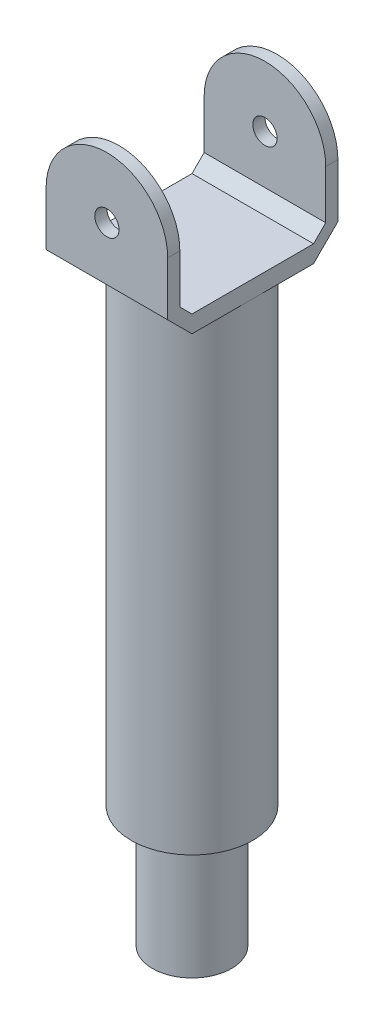
ISO-10303-21;
HEADER;
FILE_DESCRIPTION(('STEP AP214'),'2;1');
FILE_NAME('part.step','',(''),(''),'','','');
FILE_SCHEMA(('AUTOMOTIVE_DESIGN { 1 0 10303 214 1 1 1 1 }'));
ENDSEC;
DATA;
#1=APPLICATION_CONTEXT('core data for automotive mechanical design processes');
#2=APPLICATION_PROTOCOL_DEFINITION('international standard','automotive_design',2000,#1);
#3=PRODUCT_CONTEXT('',#1,'mechanical');
#4=PRODUCT('Part','Part','',(#3));
#5=PRODUCT_RELATED_PRODUCT_CATEGORY('part','',(#4));
#6=PRODUCT_DEFINITION_FORMATION('','',#4);
#7=PRODUCT_DEFINITION_CONTEXT('part definition',#1,'design');
#8=PRODUCT_DEFINITION('design','',#6,#7);
#9=PRODUCT_DEFINITION_SHAPE('','',#8);
#10=(LENGTH_UNIT() NAMED_UNIT(*) SI_UNIT(.MILLI.,.METRE.));
#11=(NAMED_UNIT(*) PLANE_ANGLE_UNIT() SI_UNIT($,.RADIAN.));
#12=(NAMED_UNIT(*) SI_UNIT($,.STERADIAN.) SOLID_ANGLE_UNIT());
#13=UNCERTAINTY_MEASURE_WITH_UNIT(LENGTH_MEASURE(1.E-05),#10,'distance_accuracy_value','');
#14=(GEOMETRIC_REPRESENTATION_CONTEXT(3) GLOBAL_UNCERTAINTY_ASSIGNED_CONTEXT((#13)) GLOBAL_UNIT_ASSIGNED_CONTEXT((#10,
#11,#12)) REPRESENTATION_CONTEXT('',''));
#15=CARTESIAN_POINT('',(0.,0.,0.));
#16=DIRECTION('',(0.,0.,1.));
#17=DIRECTION('',(1.,0.,0.));
#18=AXIS2_PLACEMENT_3D('',#15,#16,#17);
#19=CARTESIAN_POINT('',(50.,0.,0.));
#20=DIRECTION('',(-1.,0.,0.));
#21=DIRECTION('',(0.,0.,1.));
#22=AXIS2_PLACEMENT_3D('',#19,#20,#21);
#23=PLANE('',#22);
#24=DIRECTION('',(0.,0.,1.));
#25=VECTOR('',#24,1.);
#26=CARTESIAN_POINT('',(50.,550.,-70.));
#27=LINE('',#26,#25);
#28=CARTESIAN_POINT('',(50.,550.,60.));
#29=VERTEX_POINT('',#28);
#30=CARTESIAN_POINT('',(50.,550.,69.9999999999999));
#31=VERTEX_POINT('',#30);
#32=EDGE_CURVE('E243',#29,#31,#27,.T.);
#33=ORIENTED_EDGE('',*,*,#32,.T.);
#34=DIRECTION('',(0.,-1.,0.));
#35=VECTOR('',#34,1.);
#36=CARTESIAN_POINT('',(50.,600.,70.));
#37=LINE('',#36,#35);
#38=CARTESIAN_POINT('',(50.,505.857864376269,70.));
#39=VERTEX_POINT('',#38);
#40=EDGE_CURVE('E41',#31,#39,#37,.T.);
#41=ORIENTED_EDGE('',*,*,#40,.T.);
#42=DIRECTION('',(0.,-0.707106781186546,-0.707106781186549));
#43=VECTOR('',#42,1.);
#44=CARTESIAN_POINT('',(50.,505.857864376269,70.));
#45=LINE('',#44,#43);
#46=CARTESIAN_POINT('',(50.,485.857864376269,50.));
#47=VERTEX_POINT('',#46);
#48=EDGE_CURVE('E286',#39,#47,#45,.T.);
#49=ORIENTED_EDGE('',*,*,#48,.T.);
#50=DIRECTION('',(0.,0.,-1.));
#51=VECTOR('',#50,1.);
#52=CARTESIAN_POINT('',(50.,485.857864376269,50.));
#53=LINE('',#52,#51);
#54=CARTESIAN_POINT('',(50.,485.857864376269,0.));
#55=VERTEX_POINT('',#54);
#56=EDGE_CURVE('E293',#47,#55,#53,.T.);
#57=ORIENTED_EDGE('',*,*,#56,.T.);
#58=CARTESIAN_POINT('',(50.,485.857864376269,-50.));
#59=VERTEX_POINT('',#58);
#60=EDGE_CURVE('E292',#55,#59,#53,.T.);
#61=ORIENTED_EDGE('',*,*,#60,.T.);
#62=DIRECTION('',(0.,0.707106781186548,-0.707106781186546));
#63=VECTOR('',#62,1.);
#64=CARTESIAN_POINT('',(50.,485.857864376269,-50.));
#65=LINE('',#64,#63);
#66=CARTESIAN_POINT('',(50.,505.857864376269,-70.));
#67=VERTEX_POINT('',#66);
#68=EDGE_CURVE('E266',#59,#67,#65,.T.);
#69=ORIENTED_EDGE('',*,*,#68,.T.);
#70=DIRECTION('',(0.,1.,0.));
#71=VECTOR('',#70,1.);
#72=CARTESIAN_POINT('',(50.,505.857864376269,-70.));
#73=LINE('',#72,#71);
#74=CARTESIAN_POINT('',(50.,550.,-70.));
#75=VERTEX_POINT('',#74);
#76=EDGE_CURVE('E258',#67,#75,#73,.T.);
#77=ORIENTED_EDGE('',*,*,#76,.T.);
#78=CARTESIAN_POINT('',(50.,550.,-60.));
#79=VERTEX_POINT('',#78);
#80=EDGE_CURVE('E148',#75,#79,#27,.T.);
#81=ORIENTED_EDGE('',*,*,#80,.T.);
#82=DIRECTION('',(0.,-1.,0.));
#83=VECTOR('',#82,1.);
#84=CARTESIAN_POINT('',(50.,600.,-60.));
#85=LINE('',#84,#83);
#86=CARTESIAN_POINT('',(50.,510.,-60.));
#87=VERTEX_POINT('',#86);
#88=EDGE_CURVE('E255',#79,#87,#85,.T.);
#89=ORIENTED_EDGE('',*,*,#88,.T.);
#90=DIRECTION('',(0.,-0.707106781186549,0.707106781186546));
#91=VECTOR('',#90,1.);
#92=CARTESIAN_POINT('',(50.,510.,-60.));
#93=LINE('',#92,#91);
#94=CARTESIAN_POINT('',(50.,500.,-50.));
#95=VERTEX_POINT('',#94);
#96=EDGE_CURVE('E190',#87,#95,#93,.T.);
#97=ORIENTED_EDGE('',*,*,#96,.T.);
#98=DIRECTION('',(0.,0.,1.));
#99=VECTOR('',#98,1.);
#100=CARTESIAN_POINT('',(50.,500.,-50.));
#101=LINE('',#100,#99);
#102=CARTESIAN_POINT('',(50.,500.,50.));
#103=VERTEX_POINT('',#102);
#104=EDGE_CURVE('E186',#95,#103,#101,.T.);
#105=ORIENTED_EDGE('',*,*,#104,.T.);
#106=DIRECTION('',(0.,0.707106781186548,0.707106781186547));
#107=VECTOR('',#106,1.);
#108=CARTESIAN_POINT('',(50.,500.,50.));
#109=LINE('',#108,#107);
#110=CARTESIAN_POINT('',(50.,510.,60.));
#111=VERTEX_POINT('',#110);
#112=EDGE_CURVE('E284',#103,#111,#109,.T.);
#113=ORIENTED_EDGE('',*,*,#112,.T.);
#114=DIRECTION('',(0.,1.,0.));
#115=VECTOR('',#114,1.);
#116=CARTESIAN_POINT('',(50.,510.,60.));
#117=LINE('',#116,#115);
#118=EDGE_CURVE('E283',#111,#29,#117,.T.);
#119=ORIENTED_EDGE('',*,*,#118,.T.);
#120=EDGE_LOOP('',(#33,#41,#49,#57,#61,#69,#77,#81,#89,#97,#105,#113,#119));
#121=FACE_BOUND('',#120,.T.);
#122=ADVANCED_FACE('F37',(#121),#23,.F.);
#123=CARTESIAN_POINT('',(-50.,0.,0.));
#124=DIRECTION('',(-1.,0.,0.));
#125=DIRECTION('',(0.,0.,1.));
#126=AXIS2_PLACEMENT_3D('',#123,#124,#125);
#127=PLANE('',#126);
#128=DIRECTION('',(0.,-1.,0.));
#129=VECTOR('',#128,1.);
#130=CARTESIAN_POINT('',(-50.,600.,70.));
#131=LINE('',#130,#129);
#132=CARTESIAN_POINT('',(-50.,550.,70.0000059999999));
#133=VERTEX_POINT('',#132);
#134=CARTESIAN_POINT('',(-50.,505.857864376269,70.));
#135=VERTEX_POINT('',#134);
#136=EDGE_CURVE('E154',#133,#135,#131,.T.);
#137=ORIENTED_EDGE('',*,*,#136,.F.);
#138=DIRECTION('',(0.,0.,1.));
#139=VECTOR('',#138,1.);
#140=CARTESIAN_POINT('',(-50.,550.,-70.));
#141=LINE('',#140,#139);
#142=CARTESIAN_POINT('',(-50.,550.,60.));
#143=VERTEX_POINT('',#142);
#144=EDGE_CURVE('E136',#143,#133,#141,.T.);
#145=ORIENTED_EDGE('',*,*,#144,.F.);
#146=DIRECTION('',(0.,1.,0.));
#147=VECTOR('',#146,1.);
#148=CARTESIAN_POINT('',(-50.,510.,60.));
#149=LINE('',#148,#147);
#150=CARTESIAN_POINT('',(-50.,510.,60.));
#151=VERTEX_POINT('',#150);
#152=EDGE_CURVE('E163',#151,#143,#149,.T.);
#153=ORIENTED_EDGE('',*,*,#152,.F.);
#154=DIRECTION('',(0.,0.707106781186548,0.707106781186547));
#155=VECTOR('',#154,1.);
#156=CARTESIAN_POINT('',(-50.,500.,50.));
#157=LINE('',#156,#155);
#158=CARTESIAN_POINT('',(-50.,500.,50.));
#159=VERTEX_POINT('',#158);
#160=EDGE_CURVE('E166',#159,#151,#157,.T.);
#161=ORIENTED_EDGE('',*,*,#160,.F.);
#162=DIRECTION('',(0.,0.,1.));
#163=VECTOR('',#162,1.);
#164=CARTESIAN_POINT('',(-50.,500.,-50.));
#165=LINE('',#164,#163);
#166=CARTESIAN_POINT('',(-50.,500.,-50.));
#167=VERTEX_POINT('',#166);
#168=EDGE_CURVE('E270',#167,#159,#165,.T.);
#169=ORIENTED_EDGE('',*,*,#168,.F.);
#170=DIRECTION('',(0.,-0.707106781186549,0.707106781186546));
#171=VECTOR('',#170,1.);
#172=CARTESIAN_POINT('',(-50.,510.,-60.));
#173=LINE('',#172,#171);
#174=CARTESIAN_POINT('',(-50.,510.,-60.));
#175=VERTEX_POINT('',#174);
#176=EDGE_CURVE('E183',#175,#167,#173,.T.);
#177=ORIENTED_EDGE('',*,*,#176,.F.);
#178=DIRECTION('',(0.,-1.,0.));
#179=VECTOR('',#178,1.);
#180=CARTESIAN_POINT('',(-50.,600.,-60.));
#181=LINE('',#180,#179);
#182=CARTESIAN_POINT('',(-50.,550.,-60.));
#183=VERTEX_POINT('',#182);
#184=EDGE_CURVE('E181',#183,#175,#181,.T.);
#185=ORIENTED_EDGE('',*,*,#184,.F.);
#186=CARTESIAN_POINT('',(-50.,550.,-70.));
#187=VERTEX_POINT('',#186);
#188=EDGE_CURVE('E147',#187,#183,#141,.T.);
#189=ORIENTED_EDGE('',*,*,#188,.F.);
#190=DIRECTION('',(0.,1.,0.));
#191=VECTOR('',#190,1.);
#192=CARTESIAN_POINT('',(-50.,505.857864376269,-70.));
#193=LINE('',#192,#191);
#194=CARTESIAN_POINT('',(-50.,505.857864376269,-70.));
#195=VERTEX_POINT('',#194);
#196=EDGE_CURVE('E178',#195,#187,#193,.T.);
#197=ORIENTED_EDGE('',*,*,#196,.F.);
#198=DIRECTION('',(0.,0.707106781186548,-0.707106781186546));
#199=VECTOR('',#198,1.);
#200=CARTESIAN_POINT('',(-50.,485.857864376269,-50.));
#201=LINE('',#200,#199);
#202=CARTESIAN_POINT('',(-50.,485.857864376269,-50.));
#203=VERTEX_POINT('',#202);
#204=EDGE_CURVE('E176',#203,#195,#201,.T.);
#205=ORIENTED_EDGE('',*,*,#204,.F.);
#206=DIRECTION('',(0.,0.,-1.));
#207=VECTOR('',#206,1.);
#208=CARTESIAN_POINT('',(-50.,485.857864376269,50.));
#209=LINE('',#208,#207);
#210=CARTESIAN_POINT('',(-50.,485.857864376269,0.));
#211=VERTEX_POINT('',#210);
#212=EDGE_CURVE('E164',#211,#203,#209,.T.);
#213=ORIENTED_EDGE('',*,*,#212,.F.);
#214=CARTESIAN_POINT('',(-50.,485.857864376269,50.));
#215=VERTEX_POINT('',#214);
#216=EDGE_CURVE('E173',#215,#211,#209,.T.);
#217=ORIENTED_EDGE('',*,*,#216,.F.);
#218=DIRECTION('',(0.,-0.707106781186546,-0.707106781186549));
#219=VECTOR('',#218,1.);
#220=CARTESIAN_POINT('',(-50.,505.857864376269,70.));
#221=LINE('',#220,#219);
#222=EDGE_CURVE('E162',#135,#215,#221,.T.);
#223=ORIENTED_EDGE('',*,*,#222,.F.);
#224=EDGE_LOOP('',(#137,#145,#153,#161,#169,#177,#185,#189,#197,#205,#213,#217,#223));
#225=FACE_BOUND('',#224,.T.);
#226=ADVANCED_FACE('F159',(#225),#127,.T.);
#227=CARTESIAN_POINT('',(0.,500.,0.));
#228=DIRECTION('',(0.,-1.,0.));
#229=DIRECTION('',(0.,0.,-1.));
#230=AXIS2_PLACEMENT_3D('',#227,#228,#229);
#231=CYLINDRICAL_SURFACE('',#230,50.);
#232=CARTESIAN_POINT('',(0.,100.,0.));
#233=DIRECTION('',(0.,1.,0.));
#234=DIRECTION('',(0.,0.,1.));
#235=AXIS2_PLACEMENT_3D('',#232,#233,#234);
#236=CIRCLE('',#235,50.);
#237=CARTESIAN_POINT('',(0.,100.,50.));
#238=VERTEX_POINT('',#237);
#239=EDGE_CURVE('E211',#238,#238,#236,.T.);
#240=ORIENTED_EDGE('',*,*,#239,.T.);
#241=EDGE_LOOP('',(#240));
#242=FACE_BOUND('',#241,.T.);
#243=CARTESIAN_POINT('',(0.,485.857864376269,0.));
#244=DIRECTION('',(0.,1.,0.));
#245=DIRECTION('',(0.,0.,1.));
#246=AXIS2_PLACEMENT_3D('',#243,#244,#245);
#247=CIRCLE('',#246,50.);
#248=CARTESIAN_POINT('',(0.,485.857864376269,-50.));
#249=VERTEX_POINT('',#248);
#250=EDGE_CURVE('E47',#55,#249,#247,.T.);
#251=ORIENTED_EDGE('',*,*,#250,.F.);
#252=CARTESIAN_POINT('',(0.,485.857864376269,50.));
#253=VERTEX_POINT('',#252);
#254=EDGE_CURVE('E222',#253,#55,#247,.T.);
#255=ORIENTED_EDGE('',*,*,#254,.F.);
#256=EDGE_CURVE('E218',#211,#253,#247,.T.);
#257=ORIENTED_EDGE('',*,*,#256,.F.);
#258=EDGE_CURVE('E55',#249,#211,#247,.T.);
#259=ORIENTED_EDGE('',*,*,#258,.F.);
#260=EDGE_LOOP('',(#251,#255,#257,#259));
#261=FACE_BOUND('',#260,.T.);
#262=ADVANCED_FACE('F333',(#242,#261),#231,.T.);
#263=CARTESIAN_POINT('',(0.,100.,0.));
#264=DIRECTION('',(0.,-1.,0.));
#265=DIRECTION('',(0.,0.,-1.));
#266=AXIS2_PLACEMENT_3D('',#263,#264,#265);
#267=CYLINDRICAL_SURFACE('',#266,32.5);
#268=CARTESIAN_POINT('',(0.,100.,0.));
#269=DIRECTION('',(0.,1.,0.));
#270=DIRECTION('',(0.,0.,1.));
#271=AXIS2_PLACEMENT_3D('',#268,#269,#270);
#272=CIRCLE('',#271,32.5);
#273=CARTESIAN_POINT('',(0.,100.,32.5));
#274=VERTEX_POINT('',#273);
#275=EDGE_CURVE('E215',#274,#274,#272,.T.);
#276=ORIENTED_EDGE('',*,*,#275,.F.);
#277=EDGE_LOOP('',(#276));
#278=FACE_BOUND('',#277,.T.);
#279=CARTESIAN_POINT('',(0.,0.,0.));
#280=DIRECTION('',(0.,1.,0.));
#281=DIRECTION('',(0.,0.,1.));
#282=AXIS2_PLACEMENT_3D('',#279,#280,#281);
#283=CIRCLE('',#282,32.5);
#284=CARTESIAN_POINT('',(0.,0.,32.5));
#285=VERTEX_POINT('',#284);
#286=EDGE_CURVE('E214',#285,#285,#283,.T.);
#287=ORIENTED_EDGE('',*,*,#286,.T.);
#288=EDGE_LOOP('',(#287));
#289=FACE_BOUND('',#288,.T.);
#290=ADVANCED_FACE('F39',(#278,#289),#267,.T.);
#291=CARTESIAN_POINT('',(0.,0.,0.));
#292=DIRECTION('',(0.,1.,0.));
#293=DIRECTION('',(0.,0.,1.));
#294=AXIS2_PLACEMENT_3D('',#291,#292,#293);
#295=PLANE('',#294);
#296=ORIENTED_EDGE('',*,*,#286,.F.);
#297=EDGE_LOOP('',(#296));
#298=FACE_BOUND('',#297,.T.);
#299=ADVANCED_FACE('F382',(#298),#295,.F.);
#300=CARTESIAN_POINT('',(0.,100.,0.));
#301=DIRECTION('',(0.,1.,0.));
#302=DIRECTION('',(0.,0.,1.));
#303=AXIS2_PLACEMENT_3D('',#300,#301,#302);
#304=PLANE('',#303);
#305=ORIENTED_EDGE('',*,*,#275,.T.);
#306=EDGE_LOOP('',(#305));
#307=FACE_BOUND('',#306,.T.);
#308=ORIENTED_EDGE('',*,*,#239,.F.);
#309=EDGE_LOOP('',(#308));
#310=FACE_BOUND('',#309,.T.);
#311=ADVANCED_FACE('F384',(#307,#310),#304,.F.);
#312=CARTESIAN_POINT('',(50.,485.857864376269,50.));
#313=DIRECTION('',(0.,1.,0.));
#314=DIRECTION('',(0.,0.,1.));
#315=AXIS2_PLACEMENT_3D('',#312,#313,#314);
#316=PLANE('',#315);
#317=DIRECTION('',(-1.,0.,0.));
#318=VECTOR('',#317,1.);
#319=CARTESIAN_POINT('',(50.,485.857864376269,50.));
#320=LINE('',#319,#318);
#321=EDGE_CURVE('E201',#47,#253,#320,.T.);
#322=ORIENTED_EDGE('',*,*,#321,.T.);
#323=ORIENTED_EDGE('',*,*,#254,.T.);
#324=ORIENTED_EDGE('',*,*,#56,.F.);
#325=EDGE_LOOP('',(#322,#323,#324));
#326=FACE_BOUND('',#325,.T.);
#327=ADVANCED_FACE('F348',(#326),#316,.F.);
#328=ORIENTED_EDGE('',*,*,#60,.F.);
#329=ORIENTED_EDGE('',*,*,#250,.T.);
#330=DIRECTION('',(-1.,0.,0.));
#331=VECTOR('',#330,1.);
#332=CARTESIAN_POINT('',(50.,485.857864376269,-50.));
#333=LINE('',#332,#331);
#334=EDGE_CURVE('E197',#59,#249,#333,.T.);
#335=ORIENTED_EDGE('',*,*,#334,.F.);
#336=EDGE_LOOP('',(#328,#329,#335));
#337=FACE_BOUND('',#336,.T.);
#338=ADVANCED_FACE('F362',(#337),#316,.F.);
#339=EDGE_CURVE('E196',#249,#203,#333,.T.);
#340=ORIENTED_EDGE('',*,*,#339,.F.);
#341=ORIENTED_EDGE('',*,*,#258,.T.);
#342=ORIENTED_EDGE('',*,*,#212,.T.);
#343=EDGE_LOOP('',(#340,#341,#342));
#344=FACE_BOUND('',#343,.T.);
#345=ADVANCED_FACE('F349',(#344),#316,.F.);
#346=CARTESIAN_POINT('',(50.,500.,50.));
#347=DIRECTION('',(0.,-0.707106781186547,0.707106781186548));
#348=DIRECTION('',(0.,-0.707106781186548,-0.707106781186547));
#349=AXIS2_PLACEMENT_3D('',#346,#347,#348);
#350=PLANE('',#349);
#351=ORIENTED_EDGE('',*,*,#160,.T.);
#352=DIRECTION('',(-1.,0.,0.));
#353=VECTOR('',#352,1.);
#354=CARTESIAN_POINT('',(50.,510.,60.));
#355=LINE('',#354,#353);
#356=EDGE_CURVE('E206',#111,#151,#355,.T.);
#357=ORIENTED_EDGE('',*,*,#356,.F.);
#358=ORIENTED_EDGE('',*,*,#112,.F.);
#359=DIRECTION('',(-1.,0.,0.));
#360=VECTOR('',#359,1.);
#361=CARTESIAN_POINT('',(50.,500.,50.));
#362=LINE('',#361,#360);
#363=EDGE_CURVE('E209',#103,#159,#362,.T.);
#364=ORIENTED_EDGE('',*,*,#363,.T.);
#365=EDGE_LOOP('',(#351,#357,#358,#364));
#366=FACE_BOUND('',#365,.T.);
#367=ADVANCED_FACE('F275',(#366),#350,.F.);
#368=CARTESIAN_POINT('',(50.,510.,60.));
#369=DIRECTION('',(0.,0.,1.));
#370=DIRECTION('',(1.,0.,0.));
#371=AXIS2_PLACEMENT_3D('',#368,#369,#370);
#372=PLANE('',#371);
#373=CARTESIAN_POINT('',(0.,550.,60.));
#374=DIRECTION('',(0.,0.,1.));
#375=DIRECTION('',(1.,0.,0.));
#376=AXIS2_PLACEMENT_3D('',#373,#374,#375);
#377=CIRCLE('',#376,10.);
#378=CARTESIAN_POINT('',(10.,550.,60.));
#379=VERTEX_POINT('',#378);
#380=EDGE_CURVE('E156',#379,#379,#377,.T.);
#381=ORIENTED_EDGE('',*,*,#380,.T.);
#382=EDGE_LOOP('',(#381));
#383=FACE_BOUND('',#382,.T.);
#384=ORIENTED_EDGE('',*,*,#152,.T.);
#385=CARTESIAN_POINT('',(0.,550.,60.));
#386=DIRECTION('',(0.,0.,1.));
#387=DIRECTION('',(1.,0.,0.));
#388=AXIS2_PLACEMENT_3D('',#385,#386,#387);
#389=CIRCLE('',#388,50.);
#390=EDGE_CURVE('E142',#143,#29,#389,.F.);
#391=ORIENTED_EDGE('',*,*,#390,.T.);
#392=ORIENTED_EDGE('',*,*,#118,.F.);
#393=ORIENTED_EDGE('',*,*,#356,.T.);
#394=EDGE_LOOP('',(#384,#391,#392,#393));
#395=FACE_BOUND('',#394,.T.);
#396=ADVANCED_FACE('F281',(#383,#395),#372,.F.);
#397=CARTESIAN_POINT('',(50.,600.,70.));
#398=DIRECTION('',(0.,0.,-1.));
#399=DIRECTION('',(0.,1.,0.));
#400=AXIS2_PLACEMENT_3D('',#397,#398,#399);
#401=PLANE('',#400);
#402=CARTESIAN_POINT('',(0.,550.,70.));
#403=DIRECTION('',(0.,0.,-1.));
#404=DIRECTION('',(0.,1.,0.));
#405=AXIS2_PLACEMENT_3D('',#402,#403,#404);
#406=CIRCLE('',#405,10.);
#407=CARTESIAN_POINT('',(0.,560.,70.));
#408=VERTEX_POINT('',#407);
#409=EDGE_CURVE('E225',#408,#408,#406,.T.);
#410=ORIENTED_EDGE('',*,*,#409,.T.);
#411=EDGE_LOOP('',(#410));
#412=FACE_BOUND('',#411,.T.);
#413=ORIENTED_EDGE('',*,*,#40,.F.);
#414=CARTESIAN_POINT('',(0.,550.,70.));
#415=DIRECTION('',(0.,0.,-1.));
#416=DIRECTION('',(0.,1.,0.));
#417=AXIS2_PLACEMENT_3D('',#414,#415,#416);
#418=CIRCLE('',#417,50.);
#419=EDGE_CURVE('E140',#31,#133,#418,.F.);
#420=ORIENTED_EDGE('',*,*,#419,.T.);
#421=ORIENTED_EDGE('',*,*,#136,.T.);
#422=DIRECTION('',(-1.,0.,0.));
#423=VECTOR('',#422,1.);
#424=CARTESIAN_POINT('',(50.,505.857864376269,70.));
#425=LINE('',#424,#423);
#426=EDGE_CURVE('E204',#39,#135,#425,.T.);
#427=ORIENTED_EDGE('',*,*,#426,.F.);
#428=EDGE_LOOP('',(#413,#420,#421,#427));
#429=FACE_BOUND('',#428,.T.);
#430=ADVANCED_FACE('F152',(#412,#429),#401,.F.);
#431=CARTESIAN_POINT('',(50.,505.857864376269,70.));
#432=DIRECTION('',(0.,0.707106781186549,-0.707106781186546));
#433=DIRECTION('',(0.,0.707106781186546,0.707106781186549));
#434=AXIS2_PLACEMENT_3D('',#431,#432,#433);
#435=PLANE('',#434);
#436=ORIENTED_EDGE('',*,*,#222,.T.);
#437=EDGE_CURVE('E200',#253,#215,#320,.T.);
#438=ORIENTED_EDGE('',*,*,#437,.F.);
#439=ORIENTED_EDGE('',*,*,#321,.F.);
#440=ORIENTED_EDGE('',*,*,#48,.F.);
#441=ORIENTED_EDGE('',*,*,#426,.T.);
#442=EDGE_LOOP('',(#436,#438,#439,#440,#441));
#443=FACE_BOUND('',#442,.T.);
#444=ADVANCED_FACE('F346',(#443),#435,.F.);
#445=ORIENTED_EDGE('',*,*,#216,.T.);
#446=ORIENTED_EDGE('',*,*,#256,.T.);
#447=ORIENTED_EDGE('',*,*,#437,.T.);
#448=EDGE_LOOP('',(#445,#446,#447));
#449=FACE_BOUND('',#448,.T.);
#450=ADVANCED_FACE('F343',(#449),#316,.F.);
#451=CARTESIAN_POINT('',(50.,485.857864376269,-50.));
#452=DIRECTION('',(0.,0.707106781186547,0.707106781186548));
#453=DIRECTION('',(0.,-0.707106781186548,0.707106781186547));
#454=AXIS2_PLACEMENT_3D('',#451,#452,#453);
#455=PLANE('',#454);
#456=ORIENTED_EDGE('',*,*,#204,.T.);
#457=DIRECTION('',(-1.,0.,0.));
#458=VECTOR('',#457,1.);
#459=CARTESIAN_POINT('',(50.,505.857864376269,-70.));
#460=LINE('',#459,#458);
#461=EDGE_CURVE('E193',#67,#195,#460,.T.);
#462=ORIENTED_EDGE('',*,*,#461,.F.);
#463=ORIENTED_EDGE('',*,*,#68,.F.);
#464=ORIENTED_EDGE('',*,*,#334,.T.);
#465=ORIENTED_EDGE('',*,*,#339,.T.);
#466=EDGE_LOOP('',(#456,#462,#463,#464,#465));
#467=FACE_BOUND('',#466,.T.);
#468=ADVANCED_FACE('F300',(#467),#455,.F.);
#469=CARTESIAN_POINT('',(50.,505.857864376269,-70.));
#470=DIRECTION('',(0.,0.,1.));
#471=DIRECTION('',(1.,0.,0.));
#472=AXIS2_PLACEMENT_3D('',#469,#470,#471);
#473=PLANE('',#472);
#474=CARTESIAN_POINT('',(0.,550.,-70.));
#475=DIRECTION('',(0.,0.,1.));
#476=DIRECTION('',(1.,0.,0.));
#477=AXIS2_PLACEMENT_3D('',#474,#475,#476);
#478=CIRCLE('',#477,10.);
#479=CARTESIAN_POINT('',(10.,550.,-70.));
#480=VERTEX_POINT('',#479);
#481=EDGE_CURVE('E226',#480,#480,#478,.T.);
#482=ORIENTED_EDGE('',*,*,#481,.T.);
#483=EDGE_LOOP('',(#482));
#484=FACE_BOUND('',#483,.T.);
#485=ORIENTED_EDGE('',*,*,#196,.T.);
#486=CARTESIAN_POINT('',(0.,550.,-70.));
#487=DIRECTION('',(0.,0.,-1.));
#488=DIRECTION('',(1.,0.,0.));
#489=AXIS2_PLACEMENT_3D('',#486,#487,#488);
#490=CIRCLE('',#489,50.);
#491=EDGE_CURVE('E244',#187,#75,#490,.T.);
#492=ORIENTED_EDGE('',*,*,#491,.T.);
#493=ORIENTED_EDGE('',*,*,#76,.F.);
#494=ORIENTED_EDGE('',*,*,#461,.T.);
#495=EDGE_LOOP('',(#485,#492,#493,#494));
#496=FACE_BOUND('',#495,.T.);
#497=ADVANCED_FACE('F304',(#484,#496),#473,.F.);
#498=CARTESIAN_POINT('',(50.,600.,-60.));
#499=DIRECTION('',(0.,0.,-1.));
#500=DIRECTION('',(0.,1.,0.));
#501=AXIS2_PLACEMENT_3D('',#498,#499,#500);
#502=PLANE('',#501);
#503=CARTESIAN_POINT('',(0.,550.,-60.));
#504=DIRECTION('',(0.,0.,-1.));
#505=DIRECTION('',(0.,1.,0.));
#506=AXIS2_PLACEMENT_3D('',#503,#504,#505);
#507=CIRCLE('',#506,10.);
#508=CARTESIAN_POINT('',(0.,560.,-60.));
#509=VERTEX_POINT('',#508);
#510=EDGE_CURVE('E223',#509,#509,#507,.T.);
#511=ORIENTED_EDGE('',*,*,#510,.T.);
#512=EDGE_LOOP('',(#511));
#513=FACE_BOUND('',#512,.T.);
#514=CARTESIAN_POINT('',(0.,550.,-60.));
#515=DIRECTION('',(0.,0.,-1.));
#516=DIRECTION('',(0.,1.,0.));
#517=AXIS2_PLACEMENT_3D('',#514,#515,#516);
#518=CIRCLE('',#517,50.);
#519=EDGE_CURVE('E11',#79,#183,#518,.F.);
#520=ORIENTED_EDGE('',*,*,#519,.T.);
#521=ORIENTED_EDGE('',*,*,#184,.T.);
#522=DIRECTION('',(-1.,0.,0.));
#523=VECTOR('',#522,1.);
#524=CARTESIAN_POINT('',(50.,510.,-60.));
#525=LINE('',#524,#523);
#526=EDGE_CURVE('E189',#87,#175,#525,.T.);
#527=ORIENTED_EDGE('',*,*,#526,.F.);
#528=ORIENTED_EDGE('',*,*,#88,.F.);
#529=EDGE_LOOP('',(#520,#521,#527,#528));
#530=FACE_BOUND('',#529,.T.);
#531=ADVANCED_FACE('F262',(#513,#530),#502,.F.);
#532=CARTESIAN_POINT('',(50.,510.,-60.));
#533=DIRECTION('',(0.,-0.707106781186546,-0.707106781186549));
#534=DIRECTION('',(0.,0.707106781186549,-0.707106781186546));
#535=AXIS2_PLACEMENT_3D('',#532,#533,#534);
#536=PLANE('',#535);
#537=ORIENTED_EDGE('',*,*,#176,.T.);
#538=DIRECTION('',(-1.,0.,0.));
#539=VECTOR('',#538,1.);
#540=CARTESIAN_POINT('',(50.,500.,-50.));
#541=LINE('',#540,#539);
#542=EDGE_CURVE('E187',#95,#167,#541,.T.);
#543=ORIENTED_EDGE('',*,*,#542,.F.);
#544=ORIENTED_EDGE('',*,*,#96,.F.);
#545=ORIENTED_EDGE('',*,*,#526,.T.);
#546=EDGE_LOOP('',(#537,#543,#544,#545));
#547=FACE_BOUND('',#546,.T.);
#548=ADVANCED_FACE('F310',(#547),#536,.F.);
#549=CARTESIAN_POINT('',(0.,500.,0.));
#550=DIRECTION('',(0.,1.,0.));
#551=DIRECTION('',(0.,0.,1.));
#552=AXIS2_PLACEMENT_3D('',#549,#550,#551);
#553=PLANE('',#552);
#554=ORIENTED_EDGE('',*,*,#168,.T.);
#555=ORIENTED_EDGE('',*,*,#363,.F.);
#556=ORIENTED_EDGE('',*,*,#104,.F.);
#557=ORIENTED_EDGE('',*,*,#542,.T.);
#558=EDGE_LOOP('',(#554,#555,#556,#557));
#559=FACE_BOUND('',#558,.T.);
#560=ADVANCED_FACE('F314',(#559),#553,.T.);
#561=CARTESIAN_POINT('',(0.,550.,-70.));
#562=DIRECTION('',(0.,0.,1.));
#563=DIRECTION('',(1.,0.,0.));
#564=AXIS2_PLACEMENT_3D('',#561,#562,#563);
#565=CYLINDRICAL_SURFACE('',#564,10.);
#566=ORIENTED_EDGE('',*,*,#481,.F.);
#567=EDGE_LOOP('',(#566));
#568=FACE_BOUND('',#567,.T.);
#569=ORIENTED_EDGE('',*,*,#510,.F.);
#570=EDGE_LOOP('',(#569));
#571=FACE_BOUND('',#570,.T.);
#572=ADVANCED_FACE('F316',(#568,#571),#565,.F.);
#573=CARTESIAN_POINT('',(0.,550.,-70.));
#574=DIRECTION('',(0.,0.,1.));
#575=DIRECTION('',(1.,0.,0.));
#576=AXIS2_PLACEMENT_3D('',#573,#574,#575);
#577=CYLINDRICAL_SURFACE('',#576,50.);
#578=ORIENTED_EDGE('',*,*,#519,.F.);
#579=ORIENTED_EDGE('',*,*,#80,.F.);
#580=ORIENTED_EDGE('',*,*,#491,.F.);
#581=ORIENTED_EDGE('',*,*,#188,.T.);
#582=EDGE_LOOP('',(#578,#579,#580,#581));
#583=FACE_BOUND('',#582,.T.);
#584=ADVANCED_FACE('F306',(#583),#577,.T.);
#585=ORIENTED_EDGE('',*,*,#409,.F.);
#586=EDGE_LOOP('',(#585));
#587=FACE_BOUND('',#586,.T.);
#588=ORIENTED_EDGE('',*,*,#380,.F.);
#589=EDGE_LOOP('',(#588));
#590=FACE_BOUND('',#589,.T.);
#591=ADVANCED_FACE('F324',(#587,#590),#565,.F.);
#592=ORIENTED_EDGE('',*,*,#144,.T.);
#593=ORIENTED_EDGE('',*,*,#419,.F.);
#594=ORIENTED_EDGE('',*,*,#32,.F.);
#595=ORIENTED_EDGE('',*,*,#390,.F.);
#596=EDGE_LOOP('',(#592,#593,#594,#595));
#597=FACE_BOUND('',#596,.T.);
#598=ADVANCED_FACE('F138',(#597),#577,.T.);
#599=CLOSED_SHELL('',(#122,#226,#262,#290,#299,#311,#327,#338,#345,#367,#396,#430,#444,#450,
#468,#497,#531,#548,#560,#572,#584,#591,#598));
#600=MANIFOLD_SOLID_BREP('B2',#599);
#601=ADVANCED_BREP_SHAPE_REPRESENTATION('',(#18,#600),#14);
#602=SHAPE_DEFINITION_REPRESENTATION(#9,#601);
ENDSEC;
END-ISO-10303-21;
